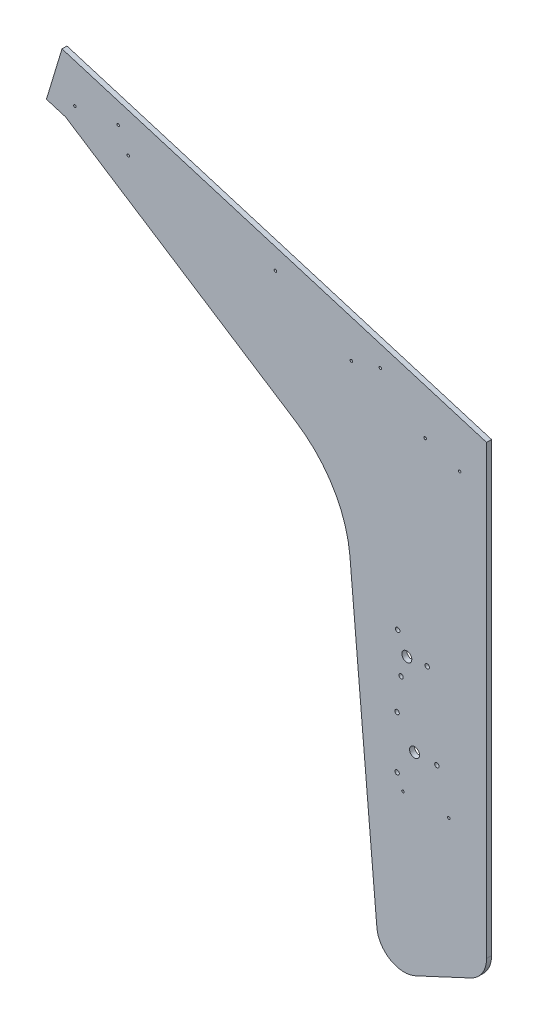
ISO-10303-21;
HEADER;
FILE_DESCRIPTION(('STEP AP214'),'2;1');
FILE_NAME('part.step','',(''),(''),'','','');
FILE_SCHEMA(('AUTOMOTIVE_DESIGN { 1 0 10303 214 1 1 1 1 }'));
ENDSEC;
DATA;
#1=APPLICATION_CONTEXT('core data for automotive mechanical design processes');
#2=APPLICATION_PROTOCOL_DEFINITION('international standard','automotive_design',2000,#1);
#3=PRODUCT_CONTEXT('',#1,'mechanical');
#4=PRODUCT('Part','Part','',(#3));
#5=PRODUCT_RELATED_PRODUCT_CATEGORY('part','',(#4));
#6=PRODUCT_DEFINITION_FORMATION('','',#4);
#7=PRODUCT_DEFINITION_CONTEXT('part definition',#1,'design');
#8=PRODUCT_DEFINITION('design','',#6,#7);
#9=PRODUCT_DEFINITION_SHAPE('','',#8);
#10=(LENGTH_UNIT() NAMED_UNIT(*) SI_UNIT(.MILLI.,.METRE.));
#11=(NAMED_UNIT(*) PLANE_ANGLE_UNIT() SI_UNIT($,.RADIAN.));
#12=(NAMED_UNIT(*) SI_UNIT($,.STERADIAN.) SOLID_ANGLE_UNIT());
#13=UNCERTAINTY_MEASURE_WITH_UNIT(LENGTH_MEASURE(1.E-05),#10,'distance_accuracy_value','');
#14=(GEOMETRIC_REPRESENTATION_CONTEXT(3) GLOBAL_UNCERTAINTY_ASSIGNED_CONTEXT((#13)) GLOBAL_UNIT_ASSIGNED_CONTEXT((#10,
#11,#12)) REPRESENTATION_CONTEXT('',''));
#15=CARTESIAN_POINT('',(0.,0.,0.));
#16=DIRECTION('',(0.,0.,1.));
#17=DIRECTION('',(1.,0.,0.));
#18=AXIS2_PLACEMENT_3D('',#15,#16,#17);
#19=CARTESIAN_POINT('',(-187.669471419218,27.9834711613111,0.));
#20=DIRECTION('',(0.,0.,1.));
#21=DIRECTION('',(1.,0.,0.));
#22=AXIS2_PLACEMENT_3D('',#19,#20,#21);
#23=PLANE('',#22);
#24=CARTESIAN_POINT('',(31.7500000000008,-184.289377226082,0.));
#25=DIRECTION('',(0.,0.,1.));
#26=DIRECTION('',(1.,0.,0.));
#27=AXIS2_PLACEMENT_3D('',#24,#25,#26);
#28=CIRCLE('',#27,1.5875);
#29=CARTESIAN_POINT('',(33.3375000000008,-184.289377226082,0.));
#30=VERTEX_POINT('',#29);
#31=EDGE_CURVE('E215',#30,#30,#28,.T.);
#32=ORIENTED_EDGE('',*,*,#31,.T.);
#33=EDGE_LOOP('',(#32));
#34=FACE_BOUND('',#33,.T.);
#35=CARTESIAN_POINT('',(90.2500000000045,-184.289377226082,0.));
#36=DIRECTION('',(0.,0.,1.));
#37=DIRECTION('',(1.,0.,0.));
#38=AXIS2_PLACEMENT_3D('',#35,#36,#37);
#39=CIRCLE('',#38,1.58750000000001);
#40=CARTESIAN_POINT('',(91.8375000000046,-184.289377226082,0.));
#41=VERTEX_POINT('',#40);
#42=EDGE_CURVE('E212',#41,#41,#39,.T.);
#43=ORIENTED_EDGE('',*,*,#42,.T.);
#44=EDGE_LOOP('',(#43));
#45=FACE_BOUND('',#44,.T.);
#46=CARTESIAN_POINT('',(103.943310592977,205.283262573305,0.));
#47=DIRECTION('',(0.,0.,1.));
#48=DIRECTION('',(1.,0.,0.));
#49=AXIS2_PLACEMENT_3D('',#46,#47,#48);
#50=CIRCLE('',#49,1.58750000000001);
#51=CARTESIAN_POINT('',(105.530810592977,205.283262573305,0.));
#52=VERTEX_POINT('',#51);
#53=EDGE_CURVE('E210',#52,#52,#50,.T.);
#54=ORIENTED_EDGE('',*,*,#53,.T.);
#55=EDGE_LOOP('',(#54));
#56=FACE_BOUND('',#55,.T.);
#57=CARTESIAN_POINT('',(60.0553843555323,220.039497831415,0.));
#58=DIRECTION('',(0.,0.,1.));
#59=DIRECTION('',(1.,0.,0.));
#60=AXIS2_PLACEMENT_3D('',#57,#58,#59);
#61=CIRCLE('',#60,1.5875);
#62=CARTESIAN_POINT('',(61.6428843555323,220.039497831415,0.));
#63=VERTEX_POINT('',#62);
#64=EDGE_CURVE('E205',#63,#63,#61,.T.);
#65=ORIENTED_EDGE('',*,*,#64,.T.);
#66=EDGE_LOOP('',(#65));
#67=FACE_BOUND('',#66,.T.);
#68=CARTESIAN_POINT('',(-34.0798681597778,258.346163074248,0.));
#69=DIRECTION('',(0.,0.,1.));
#70=DIRECTION('',(1.,0.,0.));
#71=AXIS2_PLACEMENT_3D('',#68,#69,#70);
#72=CIRCLE('',#71,1.5875);
#73=CARTESIAN_POINT('',(-32.4923681597778,258.346163074248,0.));
#74=VERTEX_POINT('',#73);
#75=EDGE_CURVE('E201',#74,#74,#72,.T.);
#76=ORIENTED_EDGE('',*,*,#75,.T.);
#77=EDGE_LOOP('',(#76));
#78=FACE_BOUND('',#77,.T.);
#79=CARTESIAN_POINT('',(-386.575717556954,363.409638801987,0.));
#80=DIRECTION('',(0.,0.,1.));
#81=DIRECTION('',(1.,0.,0.));
#82=AXIS2_PLACEMENT_3D('',#79,#80,#81);
#83=CIRCLE('',#82,1.58750000000002);
#84=CARTESIAN_POINT('',(-384.988217556954,363.409638801987,0.));
#85=VERTEX_POINT('',#84);
#86=EDGE_CURVE('E197',#85,#85,#83,.T.);
#87=ORIENTED_EDGE('',*,*,#86,.T.);
#88=EDGE_LOOP('',(#87));
#89=FACE_BOUND('',#88,.T.);
#90=CARTESIAN_POINT('',(-318.556726679748,342.823333651918,0.));
#91=DIRECTION('',(0.,0.,1.));
#92=DIRECTION('',(1.,0.,0.));
#93=AXIS2_PLACEMENT_3D('',#90,#91,#92);
#94=CIRCLE('',#93,1.58750000000002);
#95=CARTESIAN_POINT('',(-316.969226679748,342.823333651918,0.));
#96=VERTEX_POINT('',#95);
#97=EDGE_CURVE('E193',#96,#96,#94,.T.);
#98=ORIENTED_EDGE('',*,*,#97,.T.);
#99=EDGE_LOOP('',(#98));
#100=FACE_BOUND('',#99,.T.);
#101=CARTESIAN_POINT('',(-130.880979991016,309.493209449229,0.));
#102=DIRECTION('',(0.,0.,1.));
#103=DIRECTION('',(1.,0.,0.));
#104=AXIS2_PLACEMENT_3D('',#101,#102,#103);
#105=CIRCLE('',#104,1.58749999999999);
#106=CARTESIAN_POINT('',(-129.293479991016,309.493209449229,0.));
#107=VERTEX_POINT('',#106);
#108=EDGE_CURVE('E190',#107,#107,#105,.T.);
#109=ORIENTED_EDGE('',*,*,#108,.T.);
#110=EDGE_LOOP('',(#109));
#111=FACE_BOUND('',#110,.T.);
#112=CARTESIAN_POINT('',(2.82923956893905,269.025108613784,0.));
#113=DIRECTION('',(0.,0.,1.));
#114=DIRECTION('',(1.,0.,0.));
#115=AXIS2_PLACEMENT_3D('',#112,#113,#114);
#116=CIRCLE('',#115,1.5875);
#117=CARTESIAN_POINT('',(4.41673956893905,269.025108613784,0.));
#118=VERTEX_POINT('',#117);
#119=EDGE_CURVE('E185',#118,#118,#116,.T.);
#120=ORIENTED_EDGE('',*,*,#119,.T.);
#121=EDGE_LOOP('',(#120));
#122=FACE_BOUND('',#121,.T.);
#123=CARTESIAN_POINT('',(-331.446309330948,370.195360702396,0.));
#124=DIRECTION('',(0.,0.,1.));
#125=DIRECTION('',(1.,0.,0.));
#126=AXIS2_PLACEMENT_3D('',#123,#124,#125);
#127=CIRCLE('',#126,1.58750000000002);
#128=CARTESIAN_POINT('',(-329.858809330948,370.195360702396,0.));
#129=VERTEX_POINT('',#128);
#130=EDGE_CURVE('E184',#129,#129,#127,.T.);
#131=ORIENTED_EDGE('',*,*,#130,.T.);
#132=EDGE_LOOP('',(#131));
#133=FACE_BOUND('',#132,.T.);
#134=CARTESIAN_POINT('',(46.4766838917456,-133.689377226091,0.));
#135=DIRECTION('',(0.,0.,-1.));
#136=DIRECTION('',(-1.,0.,0.));
#137=AXIS2_PLACEMENT_3D('',#134,#135,#136);
#138=CIRCLE('',#137,6.35000000000762);
#139=CARTESIAN_POINT('',(40.126683891738,-133.689377226091,0.));
#140=VERTEX_POINT('',#139);
#141=EDGE_CURVE('E247',#140,#140,#138,.T.);
#142=ORIENTED_EDGE('',*,*,#141,.F.);
#143=EDGE_LOOP('',(#142));
#144=FACE_BOUND('',#143,.T.);
#145=CARTESIAN_POINT('',(36.660568119695,-32.9207261319309,0.));
#146=DIRECTION('',(0.,0.,-1.));
#147=DIRECTION('',(-1.,0.,0.));
#148=AXIS2_PLACEMENT_3D('',#145,#146,#147);
#149=CIRCLE('',#148,6.34999999999949);
#150=CARTESIAN_POINT('',(30.3105681196955,-32.9207261319309,0.));
#151=VERTEX_POINT('',#150);
#152=EDGE_CURVE('E242',#151,#151,#149,.T.);
#153=ORIENTED_EDGE('',*,*,#152,.F.);
#154=EDGE_LOOP('',(#153));
#155=FACE_BOUND('',#154,.T.);
#156=CARTESIAN_POINT('',(24.2516838917456,-100.351877226091,0.));
#157=DIRECTION('',(0.,0.,-1.));
#158=DIRECTION('',(-1.,0.,0.));
#159=AXIS2_PLACEMENT_3D('',#156,#157,#158);
#160=CIRCLE('',#159,2.80669999999999);
#161=CARTESIAN_POINT('',(21.4449838917456,-100.351877226091,0.));
#162=VERTEX_POINT('',#161);
#163=EDGE_CURVE('E246',#162,#162,#160,.T.);
#164=ORIENTED_EDGE('',*,*,#163,.F.);
#165=EDGE_LOOP('',(#164));
#166=FACE_BOUND('',#165,.T.);
#167=CARTESIAN_POINT('',(24.2516838917456,-167.026877226091,0.));
#168=DIRECTION('',(0.,0.,-1.));
#169=DIRECTION('',(-1.,0.,0.));
#170=AXIS2_PLACEMENT_3D('',#167,#168,#169);
#171=CIRCLE('',#170,2.80669999999999);
#172=CARTESIAN_POINT('',(21.4449838917456,-167.026877226091,0.));
#173=VERTEX_POINT('',#172);
#174=EDGE_CURVE('E260',#173,#173,#171,.T.);
#175=ORIENTED_EDGE('',*,*,#174,.F.);
#176=EDGE_LOOP('',(#175));
#177=FACE_BOUND('',#176,.T.);
#178=CARTESIAN_POINT('',(75.0516838917456,-133.689377226091,0.));
#179=DIRECTION('',(0.,0.,-1.));
#180=DIRECTION('',(-1.,0.,0.));
#181=AXIS2_PLACEMENT_3D('',#178,#179,#180);
#182=CIRCLE('',#181,2.80669999999998);
#183=CARTESIAN_POINT('',(72.2449838917456,-133.689377226091,0.));
#184=VERTEX_POINT('',#183);
#185=EDGE_CURVE('E266',#184,#184,#182,.T.);
#186=ORIENTED_EDGE('',*,*,#185,.F.);
#187=EDGE_LOOP('',(#186));
#188=FACE_BOUND('',#187,.T.);
#189=CARTESIAN_POINT('',(29.3173696682906,-58.2747024278338,0.));
#190=DIRECTION('',(0.,0.,-1.));
#191=DIRECTION('',(-1.,0.,0.));
#192=AXIS2_PLACEMENT_3D('',#189,#190,#191);
#193=CIRCLE('',#192,2.80669999999999);
#194=CARTESIAN_POINT('',(26.5106696682906,-58.2747024278338,0.));
#195=VERTEX_POINT('',#194);
#196=EDGE_CURVE('E272',#195,#195,#193,.T.);
#197=ORIENTED_EDGE('',*,*,#196,.F.);
#198=EDGE_LOOP('',(#197));
#199=FACE_BOUND('',#198,.T.);
#200=CARTESIAN_POINT('',(62.6487752038756,-30.6470526267015,0.));
#201=DIRECTION('',(0.,0.,-1.));
#202=DIRECTION('',(-1.,0.,0.));
#203=AXIS2_PLACEMENT_3D('',#200,#201,#202);
#204=CIRCLE('',#203,2.8067);
#205=CARTESIAN_POINT('',(59.8420752038756,-30.6470526267015,0.));
#206=VERTEX_POINT('',#205);
#207=EDGE_CURVE('E284',#206,#206,#204,.T.);
#208=ORIENTED_EDGE('',*,*,#207,.F.);
#209=EDGE_LOOP('',(#208));
#210=FACE_BOUND('',#209,.T.);
#211=CARTESIAN_POINT('',(-187.669471419218,27.9834711613111,0.));
#212=DIRECTION('',(0.,0.,-1.));
#213=DIRECTION('',(1.,0.,0.));
#214=AXIS2_PLACEMENT_3D('',#211,#212,#213);
#215=CIRCLE('',#214,152.4);
#216=CARTESIAN_POINT('',(-105.026598758452,156.030008007789,0.));
#217=VERTEX_POINT('',#216);
#218=CARTESIAN_POINT('',(-35.929687434797,42.1537907187927,0.));
#219=VERTEX_POINT('',#218);
#220=EDGE_CURVE('E144',#217,#219,#215,.T.);
#221=ORIENTED_EDGE('',*,*,#220,.F.);
#222=DIRECTION('',(0.840200373008384,-0.542276067327862,0.));
#223=VECTOR('',#222,1.);
#224=CARTESIAN_POINT('',(-398.624090476111,345.521584422964,0.));
#225=LINE('',#224,#223);
#226=CARTESIAN_POINT('',(-398.624090476111,345.521584422964,0.));
#227=VERTEX_POINT('',#226);
#228=EDGE_CURVE('E93',#227,#217,#225,.T.);
#229=ORIENTED_EDGE('',*,*,#228,.F.);
#230=DIRECTION('',(0.957123976807143,-0.289678602973846,0.));
#231=VECTOR('',#230,1.);
#232=CARTESIAN_POINT('',(-422.935039487013,352.879420938499,0.));
#233=LINE('',#232,#231);
#234=CARTESIAN_POINT('',(-422.935039487013,352.879420938499,0.));
#235=VERTEX_POINT('',#234);
#236=EDGE_CURVE('E87',#235,#227,#233,.T.);
#237=ORIENTED_EDGE('',*,*,#236,.F.);
#238=DIRECTION('',(-0.289678602973846,-0.957123976807143,0.));
#239=VECTOR('',#238,1.);
#240=CARTESIAN_POINT('',(-403.099057100862,418.419278388803,0.));
#241=LINE('',#240,#239);
#242=CARTESIAN_POINT('',(-403.099057100862,418.419278388803,0.));
#243=VERTEX_POINT('',#242);
#244=EDGE_CURVE('E134',#243,#235,#241,.T.);
#245=ORIENTED_EDGE('',*,*,#244,.F.);
#246=DIRECTION('',(-0.957123976807143,0.289678602973846,0.));
#247=VECTOR('',#246,1.);
#248=CARTESIAN_POINT('',(138.378918257769,254.538122714234,0.));
#249=LINE('',#248,#247);
#250=CARTESIAN_POINT('',(138.378918257769,254.538122714234,0.));
#251=VERTEX_POINT('',#250);
#252=EDGE_CURVE('E158',#251,#243,#249,.T.);
#253=ORIENTED_EDGE('',*,*,#252,.F.);
#254=DIRECTION('',(0.,1.,0.));
#255=VECTOR('',#254,1.);
#256=CARTESIAN_POINT('',(138.378918257769,-315.453385963652,0.));
#257=LINE('',#256,#255);
#258=CARTESIAN_POINT('',(138.378918257769,-315.453385963652,0.));
#259=VERTEX_POINT('',#258);
#260=EDGE_CURVE('E156',#259,#251,#257,.T.);
#261=ORIENTED_EDGE('',*,*,#260,.F.);
#262=CARTESIAN_POINT('',(103.453918257769,-315.453385963652,0.));
#263=DIRECTION('',(0.,0.,1.));
#264=DIRECTION('',(1.,0.,0.));
#265=AXIS2_PLACEMENT_3D('',#262,#263,#264);
#266=CIRCLE('',#265,34.925);
#267=CARTESIAN_POINT('',(118.213861049063,-347.106185425907,0.));
#268=VERTEX_POINT('',#267);
#269=EDGE_CURVE('E154',#268,#259,#266,.T.);
#270=ORIENTED_EDGE('',*,*,#269,.F.);
#271=DIRECTION('',(0.906307787036646,0.422618261740709,0.));
#272=VECTOR('',#271,1.);
#273=CARTESIAN_POINT('',(48.0381691425684,-379.829647978231,0.));
#274=LINE('',#273,#272);
#275=CARTESIAN_POINT('',(48.0381691425684,-379.829647978231,0.));
#276=VERTEX_POINT('',#275);
#277=EDGE_CURVE('E152',#276,#268,#274,.T.);
#278=ORIENTED_EDGE('',*,*,#277,.F.);
#279=CARTESIAN_POINT('',(33.2782263512746,-348.176848515976,0.));
#280=DIRECTION('',(0.,0.,1.));
#281=DIRECTION('',(1.,0.,0.));
#282=AXIS2_PLACEMENT_3D('',#279,#280,#281);
#283=CIRCLE('',#282,34.925);
#284=CARTESIAN_POINT('',(-1.51387347957959,-351.220762831439,0.));
#285=VERTEX_POINT('',#284);
#286=EDGE_CURVE('E150',#285,#276,#283,.T.);
#287=ORIENTED_EDGE('',*,*,#286,.F.);
#288=DIRECTION('',(0.0871557427476597,-0.996194698091745,0.));
#289=VECTOR('',#288,1.);
#290=CARTESIAN_POINT('',(-35.929687434797,42.1537907187927,0.));
#291=LINE('',#290,#289);
#292=EDGE_CURVE('E147',#219,#285,#291,.T.);
#293=ORIENTED_EDGE('',*,*,#292,.F.);
#294=EDGE_LOOP('',(#221,#229,#237,#245,#253,#261,#270,#278,#287,#293));
#295=FACE_BOUND('',#294,.T.);
#296=CARTESIAN_POINT('',(25.0262575724516,-9.22706673537058,0.));
#297=DIRECTION('',(0.,0.,-1.));
#298=DIRECTION('',(-1.,0.,0.));
#299=AXIS2_PLACEMENT_3D('',#296,#297,#298);
#300=CIRCLE('',#299,2.80669999999999);
#301=CARTESIAN_POINT('',(22.2195575724516,-9.22706673537058,0.));
#302=VERTEX_POINT('',#301);
#303=EDGE_CURVE('E278',#302,#302,#300,.T.);
#304=ORIENTED_EDGE('',*,*,#303,.F.);
#305=EDGE_LOOP('',(#304));
#306=FACE_BOUND('',#305,.T.);
#307=ADVANCED_FACE('F33',(#34,#45,#56,#67,#78,#89,#100,#111,#122,#133,#144,#155,#166,#177,#188,
#199,#210,#295,#306),#23,.F.);
#308=CARTESIAN_POINT('',(-187.669471419218,27.9834711613111,6.35));
#309=DIRECTION('',(0.,0.,-1.));
#310=DIRECTION('',(-1.,0.,0.));
#311=AXIS2_PLACEMENT_3D('',#308,#309,#310);
#312=CYLINDRICAL_SURFACE('',#311,152.4);
#313=ORIENTED_EDGE('',*,*,#220,.T.);
#314=DIRECTION('',(0.,0.,-1.));
#315=VECTOR('',#314,1.);
#316=CARTESIAN_POINT('',(-35.929687434797,42.1537907187927,6.35));
#317=LINE('',#316,#315);
#318=CARTESIAN_POINT('',(-35.929687434797,42.1537907187927,6.35));
#319=VERTEX_POINT('',#318);
#320=EDGE_CURVE('E11',#319,#219,#317,.T.);
#321=ORIENTED_EDGE('',*,*,#320,.F.);
#322=CARTESIAN_POINT('',(-187.669471419218,27.9834711613111,6.35));
#323=DIRECTION('',(0.,0.,-1.));
#324=DIRECTION('',(1.,0.,0.));
#325=AXIS2_PLACEMENT_3D('',#322,#323,#324);
#326=CIRCLE('',#325,152.4);
#327=CARTESIAN_POINT('',(-105.026598758452,156.030008007789,6.35));
#328=VERTEX_POINT('',#327);
#329=EDGE_CURVE('E163',#328,#319,#326,.T.);
#330=ORIENTED_EDGE('',*,*,#329,.F.);
#331=DIRECTION('',(0.,0.,-1.));
#332=VECTOR('',#331,1.);
#333=CARTESIAN_POINT('',(-105.026598758452,156.030008007789,6.35));
#334=LINE('',#333,#332);
#335=EDGE_CURVE('E140',#328,#217,#334,.T.);
#336=ORIENTED_EDGE('',*,*,#335,.T.);
#337=EDGE_LOOP('',(#313,#321,#330,#336));
#338=FACE_BOUND('',#337,.T.);
#339=ADVANCED_FACE('F35',(#338),#312,.F.);
#340=CARTESIAN_POINT('',(-35.929687434797,42.1537907187927,6.35));
#341=DIRECTION('',(0.996194698091745,0.0871557427476597,0.));
#342=DIRECTION('',(-0.0871557427476597,0.996194698091745,0.));
#343=AXIS2_PLACEMENT_3D('',#340,#341,#342);
#344=PLANE('',#343);
#345=ORIENTED_EDGE('',*,*,#292,.T.);
#346=DIRECTION('',(0.,0.,-1.));
#347=VECTOR('',#346,1.);
#348=CARTESIAN_POINT('',(-1.51387347957959,-351.220762831439,6.35));
#349=LINE('',#348,#347);
#350=CARTESIAN_POINT('',(-1.51387347957959,-351.220762831439,6.35));
#351=VERTEX_POINT('',#350);
#352=EDGE_CURVE('E43',#351,#285,#349,.T.);
#353=ORIENTED_EDGE('',*,*,#352,.F.);
#354=DIRECTION('',(0.0871557427476597,-0.996194698091745,0.));
#355=VECTOR('',#354,1.);
#356=CARTESIAN_POINT('',(-35.929687434797,42.1537907187927,6.35));
#357=LINE('',#356,#355);
#358=EDGE_CURVE('E101',#319,#351,#357,.T.);
#359=ORIENTED_EDGE('',*,*,#358,.F.);
#360=ORIENTED_EDGE('',*,*,#320,.T.);
#361=EDGE_LOOP('',(#345,#353,#359,#360));
#362=FACE_BOUND('',#361,.T.);
#363=ADVANCED_FACE('F331',(#362),#344,.F.);
#364=CARTESIAN_POINT('',(33.2782263512746,-348.176848515976,6.35));
#365=DIRECTION('',(0.,0.,-1.));
#366=DIRECTION('',(-1.,0.,0.));
#367=AXIS2_PLACEMENT_3D('',#364,#365,#366);
#368=CYLINDRICAL_SURFACE('',#367,34.925);
#369=ORIENTED_EDGE('',*,*,#286,.T.);
#370=DIRECTION('',(0.,0.,-1.));
#371=VECTOR('',#370,1.);
#372=CARTESIAN_POINT('',(48.0381691425684,-379.829647978231,6.35));
#373=LINE('',#372,#371);
#374=CARTESIAN_POINT('',(48.0381691425684,-379.829647978231,6.35));
#375=VERTEX_POINT('',#374);
#376=EDGE_CURVE('E176',#375,#276,#373,.T.);
#377=ORIENTED_EDGE('',*,*,#376,.F.);
#378=CARTESIAN_POINT('',(33.2782263512746,-348.176848515976,6.35));
#379=DIRECTION('',(0.,0.,1.));
#380=DIRECTION('',(1.,0.,0.));
#381=AXIS2_PLACEMENT_3D('',#378,#379,#380);
#382=CIRCLE('',#381,34.925);
#383=EDGE_CURVE('E291',#351,#375,#382,.T.);
#384=ORIENTED_EDGE('',*,*,#383,.F.);
#385=ORIENTED_EDGE('',*,*,#352,.T.);
#386=EDGE_LOOP('',(#369,#377,#384,#385));
#387=FACE_BOUND('',#386,.T.);
#388=ADVANCED_FACE('F649',(#387),#368,.T.);
#389=CARTESIAN_POINT('',(48.0381691425684,-379.829647978231,6.35));
#390=DIRECTION('',(-0.422618261740709,0.906307787036646,0.));
#391=DIRECTION('',(-0.906307787036646,-0.422618261740709,0.));
#392=AXIS2_PLACEMENT_3D('',#389,#390,#391);
#393=PLANE('',#392);
#394=ORIENTED_EDGE('',*,*,#277,.T.);
#395=DIRECTION('',(0.,0.,-1.));
#396=VECTOR('',#395,1.);
#397=CARTESIAN_POINT('',(118.213861049063,-347.106185425907,6.35));
#398=LINE('',#397,#396);
#399=CARTESIAN_POINT('',(118.213861049063,-347.106185425907,6.35));
#400=VERTEX_POINT('',#399);
#401=EDGE_CURVE('E173',#400,#268,#398,.T.);
#402=ORIENTED_EDGE('',*,*,#401,.F.);
#403=DIRECTION('',(0.906307787036646,0.422618261740709,0.));
#404=VECTOR('',#403,1.);
#405=CARTESIAN_POINT('',(48.0381691425684,-379.829647978231,6.35));
#406=LINE('',#405,#404);
#407=EDGE_CURVE('E293',#375,#400,#406,.T.);
#408=ORIENTED_EDGE('',*,*,#407,.F.);
#409=ORIENTED_EDGE('',*,*,#376,.T.);
#410=EDGE_LOOP('',(#394,#402,#408,#409));
#411=FACE_BOUND('',#410,.T.);
#412=ADVANCED_FACE('F640',(#411),#393,.F.);
#413=CARTESIAN_POINT('',(103.453918257769,-315.453385963652,6.35));
#414=DIRECTION('',(0.,0.,-1.));
#415=DIRECTION('',(-1.,0.,0.));
#416=AXIS2_PLACEMENT_3D('',#413,#414,#415);
#417=CYLINDRICAL_SURFACE('',#416,34.925);
#418=ORIENTED_EDGE('',*,*,#269,.T.);
#419=DIRECTION('',(0.,0.,-1.));
#420=VECTOR('',#419,1.);
#421=CARTESIAN_POINT('',(138.378918257769,-315.453385963652,6.35));
#422=LINE('',#421,#420);
#423=CARTESIAN_POINT('',(138.378918257769,-315.453385963652,6.35));
#424=VERTEX_POINT('',#423);
#425=EDGE_CURVE('E170',#424,#259,#422,.T.);
#426=ORIENTED_EDGE('',*,*,#425,.F.);
#427=CARTESIAN_POINT('',(103.453918257769,-315.453385963652,6.35));
#428=DIRECTION('',(0.,0.,1.));
#429=DIRECTION('',(1.,0.,0.));
#430=AXIS2_PLACEMENT_3D('',#427,#428,#429);
#431=CIRCLE('',#430,34.925);
#432=EDGE_CURVE('E295',#400,#424,#431,.T.);
#433=ORIENTED_EDGE('',*,*,#432,.F.);
#434=ORIENTED_EDGE('',*,*,#401,.T.);
#435=EDGE_LOOP('',(#418,#426,#433,#434));
#436=FACE_BOUND('',#435,.T.);
#437=ADVANCED_FACE('F632',(#436),#417,.T.);
#438=CARTESIAN_POINT('',(138.378918257769,-315.453385963652,6.35));
#439=DIRECTION('',(-1.,0.,0.));
#440=DIRECTION('',(0.,-1.,0.));
#441=AXIS2_PLACEMENT_3D('',#438,#439,#440);
#442=PLANE('',#441);
#443=ORIENTED_EDGE('',*,*,#260,.T.);
#444=DIRECTION('',(0.,0.,-1.));
#445=VECTOR('',#444,1.);
#446=CARTESIAN_POINT('',(138.378918257769,254.538122714234,6.35));
#447=LINE('',#446,#445);
#448=CARTESIAN_POINT('',(138.378918257769,254.538122714234,6.35));
#449=VERTEX_POINT('',#448);
#450=EDGE_CURVE('E167',#449,#251,#447,.T.);
#451=ORIENTED_EDGE('',*,*,#450,.F.);
#452=DIRECTION('',(0.,1.,0.));
#453=VECTOR('',#452,1.);
#454=CARTESIAN_POINT('',(138.378918257769,-315.453385963652,6.35));
#455=LINE('',#454,#453);
#456=EDGE_CURVE('E297',#424,#449,#455,.T.);
#457=ORIENTED_EDGE('',*,*,#456,.F.);
#458=ORIENTED_EDGE('',*,*,#425,.T.);
#459=EDGE_LOOP('',(#443,#451,#457,#458));
#460=FACE_BOUND('',#459,.T.);
#461=ADVANCED_FACE('F303',(#460),#442,.F.);
#462=CARTESIAN_POINT('',(138.378918257769,254.538122714234,6.35));
#463=DIRECTION('',(-0.289678602973846,-0.957123976807143,0.));
#464=DIRECTION('',(0.957123976807143,-0.289678602973846,0.));
#465=AXIS2_PLACEMENT_3D('',#462,#463,#464);
#466=PLANE('',#465);
#467=ORIENTED_EDGE('',*,*,#252,.T.);
#468=DIRECTION('',(0.,0.,-1.));
#469=VECTOR('',#468,1.);
#470=CARTESIAN_POINT('',(-403.099057100862,418.419278388803,6.35));
#471=LINE('',#470,#469);
#472=CARTESIAN_POINT('',(-403.099057100862,418.419278388803,6.35));
#473=VERTEX_POINT('',#472);
#474=EDGE_CURVE('E135',#473,#243,#471,.T.);
#475=ORIENTED_EDGE('',*,*,#474,.F.);
#476=DIRECTION('',(-0.957123976807143,0.289678602973846,0.));
#477=VECTOR('',#476,1.);
#478=CARTESIAN_POINT('',(138.378918257769,254.538122714234,6.35));
#479=LINE('',#478,#477);
#480=EDGE_CURVE('E126',#449,#473,#479,.T.);
#481=ORIENTED_EDGE('',*,*,#480,.F.);
#482=ORIENTED_EDGE('',*,*,#450,.T.);
#483=EDGE_LOOP('',(#467,#475,#481,#482));
#484=FACE_BOUND('',#483,.T.);
#485=ADVANCED_FACE('F307',(#484),#466,.F.);
#486=CARTESIAN_POINT('',(-403.099057100862,418.419278388803,6.35));
#487=DIRECTION('',(0.957123976807143,-0.289678602973846,0.));
#488=DIRECTION('',(0.289678602973846,0.957123976807143,0.));
#489=AXIS2_PLACEMENT_3D('',#486,#487,#488);
#490=PLANE('',#489);
#491=ORIENTED_EDGE('',*,*,#244,.T.);
#492=DIRECTION('',(0.,0.,-1.));
#493=VECTOR('',#492,1.);
#494=CARTESIAN_POINT('',(-422.935039487013,352.879420938499,6.35));
#495=LINE('',#494,#493);
#496=CARTESIAN_POINT('',(-422.935039487013,352.879420938499,6.35));
#497=VERTEX_POINT('',#496);
#498=EDGE_CURVE('E131',#497,#235,#495,.T.);
#499=ORIENTED_EDGE('',*,*,#498,.F.);
#500=DIRECTION('',(-0.289678602973846,-0.957123976807143,0.));
#501=VECTOR('',#500,1.);
#502=CARTESIAN_POINT('',(-403.099057100862,418.419278388803,6.35));
#503=LINE('',#502,#501);
#504=EDGE_CURVE('E120',#473,#497,#503,.T.);
#505=ORIENTED_EDGE('',*,*,#504,.F.);
#506=ORIENTED_EDGE('',*,*,#474,.T.);
#507=EDGE_LOOP('',(#491,#499,#505,#506));
#508=FACE_BOUND('',#507,.T.);
#509=ADVANCED_FACE('F132',(#508),#490,.F.);
#510=CARTESIAN_POINT('',(-422.935039487013,352.879420938499,6.35));
#511=DIRECTION('',(0.289678602973846,0.957123976807143,0.));
#512=DIRECTION('',(-0.957123976807143,0.289678602973846,0.));
#513=AXIS2_PLACEMENT_3D('',#510,#511,#512);
#514=PLANE('',#513);
#515=ORIENTED_EDGE('',*,*,#236,.T.);
#516=DIRECTION('',(0.,0.,-1.));
#517=VECTOR('',#516,1.);
#518=CARTESIAN_POINT('',(-398.624090476111,345.521584422964,6.35));
#519=LINE('',#518,#517);
#520=CARTESIAN_POINT('',(-398.624090476111,345.521584422964,6.35));
#521=VERTEX_POINT('',#520);
#522=EDGE_CURVE('E136',#521,#227,#519,.T.);
#523=ORIENTED_EDGE('',*,*,#522,.F.);
#524=DIRECTION('',(0.957123976807143,-0.289678602973846,0.));
#525=VECTOR('',#524,1.);
#526=CARTESIAN_POINT('',(-422.935039487013,352.879420938499,6.35));
#527=LINE('',#526,#525);
#528=EDGE_CURVE('E124',#497,#521,#527,.T.);
#529=ORIENTED_EDGE('',*,*,#528,.F.);
#530=ORIENTED_EDGE('',*,*,#498,.T.);
#531=EDGE_LOOP('',(#515,#523,#529,#530));
#532=FACE_BOUND('',#531,.T.);
#533=ADVANCED_FACE('F138',(#532),#514,.F.);
#534=CARTESIAN_POINT('',(-398.624090476111,345.521584422964,6.35));
#535=DIRECTION('',(0.542276067327862,0.840200373008384,0.));
#536=DIRECTION('',(-0.840200373008384,0.542276067327862,0.));
#537=AXIS2_PLACEMENT_3D('',#534,#535,#536);
#538=PLANE('',#537);
#539=ORIENTED_EDGE('',*,*,#228,.T.);
#540=ORIENTED_EDGE('',*,*,#335,.F.);
#541=DIRECTION('',(0.840200373008384,-0.542276067327862,0.));
#542=VECTOR('',#541,1.);
#543=CARTESIAN_POINT('',(-398.624090476111,345.521584422964,6.35));
#544=LINE('',#543,#542);
#545=EDGE_CURVE('E52',#521,#328,#544,.T.);
#546=ORIENTED_EDGE('',*,*,#545,.F.);
#547=ORIENTED_EDGE('',*,*,#522,.T.);
#548=EDGE_LOOP('',(#539,#540,#546,#547));
#549=FACE_BOUND('',#548,.T.);
#550=ADVANCED_FACE('F315',(#549),#538,.F.);
#551=CARTESIAN_POINT('',(-187.669471419218,27.9834711613111,6.35));
#552=DIRECTION('',(0.,0.,1.));
#553=DIRECTION('',(1.,0.,0.));
#554=AXIS2_PLACEMENT_3D('',#551,#552,#553);
#555=PLANE('',#554);
#556=CARTESIAN_POINT('',(31.7500000000008,-184.289377226082,6.35));
#557=DIRECTION('',(0.,0.,1.));
#558=DIRECTION('',(1.,0.,0.));
#559=AXIS2_PLACEMENT_3D('',#556,#557,#558);
#560=CIRCLE('',#559,1.5875);
#561=CARTESIAN_POINT('',(33.3375000000008,-184.289377226082,6.35));
#562=VERTEX_POINT('',#561);
#563=EDGE_CURVE('E37',#562,#562,#560,.T.);
#564=ORIENTED_EDGE('',*,*,#563,.F.);
#565=EDGE_LOOP('',(#564));
#566=FACE_BOUND('',#565,.T.);
#567=CARTESIAN_POINT('',(90.2500000000045,-184.289377226082,6.35));
#568=DIRECTION('',(0.,0.,1.));
#569=DIRECTION('',(1.,0.,0.));
#570=AXIS2_PLACEMENT_3D('',#567,#568,#569);
#571=CIRCLE('',#570,1.58750000000001);
#572=CARTESIAN_POINT('',(91.8375000000046,-184.289377226082,6.35));
#573=VERTEX_POINT('',#572);
#574=EDGE_CURVE('E213',#573,#573,#571,.T.);
#575=ORIENTED_EDGE('',*,*,#574,.F.);
#576=EDGE_LOOP('',(#575));
#577=FACE_BOUND('',#576,.T.);
#578=CARTESIAN_POINT('',(103.943310592977,205.283262573305,6.35));
#579=DIRECTION('',(0.,0.,1.));
#580=DIRECTION('',(1.,0.,0.));
#581=AXIS2_PLACEMENT_3D('',#578,#579,#580);
#582=CIRCLE('',#581,1.58750000000001);
#583=CARTESIAN_POINT('',(105.530810592977,205.283262573305,6.35));
#584=VERTEX_POINT('',#583);
#585=EDGE_CURVE('E209',#584,#584,#582,.T.);
#586=ORIENTED_EDGE('',*,*,#585,.F.);
#587=EDGE_LOOP('',(#586));
#588=FACE_BOUND('',#587,.T.);
#589=CARTESIAN_POINT('',(60.0553843555323,220.039497831415,6.35));
#590=DIRECTION('',(0.,0.,1.));
#591=DIRECTION('',(1.,0.,0.));
#592=AXIS2_PLACEMENT_3D('',#589,#590,#591);
#593=CIRCLE('',#592,1.5875);
#594=CARTESIAN_POINT('',(61.6428843555323,220.039497831415,6.35));
#595=VERTEX_POINT('',#594);
#596=EDGE_CURVE('E206',#595,#595,#593,.T.);
#597=ORIENTED_EDGE('',*,*,#596,.F.);
#598=EDGE_LOOP('',(#597));
#599=FACE_BOUND('',#598,.T.);
#600=CARTESIAN_POINT('',(-34.0798681597778,258.346163074248,6.35));
#601=DIRECTION('',(0.,0.,1.));
#602=DIRECTION('',(1.,0.,0.));
#603=AXIS2_PLACEMENT_3D('',#600,#601,#602);
#604=CIRCLE('',#603,1.5875);
#605=CARTESIAN_POINT('',(-32.4923681597778,258.346163074248,6.35));
#606=VERTEX_POINT('',#605);
#607=EDGE_CURVE('E202',#606,#606,#604,.T.);
#608=ORIENTED_EDGE('',*,*,#607,.F.);
#609=EDGE_LOOP('',(#608));
#610=FACE_BOUND('',#609,.T.);
#611=CARTESIAN_POINT('',(-386.575717556954,363.409638801987,6.35));
#612=DIRECTION('',(0.,0.,1.));
#613=DIRECTION('',(1.,0.,0.));
#614=AXIS2_PLACEMENT_3D('',#611,#612,#613);
#615=CIRCLE('',#614,1.58750000000002);
#616=CARTESIAN_POINT('',(-384.988217556954,363.409638801987,6.35));
#617=VERTEX_POINT('',#616);
#618=EDGE_CURVE('E198',#617,#617,#615,.T.);
#619=ORIENTED_EDGE('',*,*,#618,.F.);
#620=EDGE_LOOP('',(#619));
#621=FACE_BOUND('',#620,.T.);
#622=CARTESIAN_POINT('',(-318.556726679748,342.823333651918,6.35));
#623=DIRECTION('',(0.,0.,1.));
#624=DIRECTION('',(1.,0.,0.));
#625=AXIS2_PLACEMENT_3D('',#622,#623,#624);
#626=CIRCLE('',#625,1.58750000000002);
#627=CARTESIAN_POINT('',(-316.969226679748,342.823333651918,6.35));
#628=VERTEX_POINT('',#627);
#629=EDGE_CURVE('E194',#628,#628,#626,.T.);
#630=ORIENTED_EDGE('',*,*,#629,.F.);
#631=EDGE_LOOP('',(#630));
#632=FACE_BOUND('',#631,.T.);
#633=CARTESIAN_POINT('',(-130.880979991016,309.493209449229,6.35));
#634=DIRECTION('',(0.,0.,1.));
#635=DIRECTION('',(1.,0.,0.));
#636=AXIS2_PLACEMENT_3D('',#633,#634,#635);
#637=CIRCLE('',#636,1.58749999999999);
#638=CARTESIAN_POINT('',(-129.293479991016,309.493209449229,6.35));
#639=VERTEX_POINT('',#638);
#640=EDGE_CURVE('E189',#639,#639,#637,.T.);
#641=ORIENTED_EDGE('',*,*,#640,.F.);
#642=EDGE_LOOP('',(#641));
#643=FACE_BOUND('',#642,.T.);
#644=CARTESIAN_POINT('',(2.82923956893905,269.025108613784,6.35));
#645=DIRECTION('',(0.,0.,1.));
#646=DIRECTION('',(1.,0.,0.));
#647=AXIS2_PLACEMENT_3D('',#644,#645,#646);
#648=CIRCLE('',#647,1.5875);
#649=CARTESIAN_POINT('',(4.41673956893905,269.025108613784,6.35));
#650=VERTEX_POINT('',#649);
#651=EDGE_CURVE('E186',#650,#650,#648,.T.);
#652=ORIENTED_EDGE('',*,*,#651,.F.);
#653=EDGE_LOOP('',(#652));
#654=FACE_BOUND('',#653,.T.);
#655=CARTESIAN_POINT('',(-331.446309330948,370.195360702396,6.35));
#656=DIRECTION('',(0.,0.,1.));
#657=DIRECTION('',(1.,0.,0.));
#658=AXIS2_PLACEMENT_3D('',#655,#656,#657);
#659=CIRCLE('',#658,1.58750000000002);
#660=CARTESIAN_POINT('',(-329.858809330948,370.195360702396,6.35));
#661=VERTEX_POINT('',#660);
#662=EDGE_CURVE('E181',#661,#661,#659,.T.);
#663=ORIENTED_EDGE('',*,*,#662,.F.);
#664=EDGE_LOOP('',(#663));
#665=FACE_BOUND('',#664,.T.);
#666=CARTESIAN_POINT('',(46.4766838917456,-133.689377226091,6.35));
#667=DIRECTION('',(0.,0.,-1.));
#668=DIRECTION('',(-1.,0.,0.));
#669=AXIS2_PLACEMENT_3D('',#666,#667,#668);
#670=CIRCLE('',#669,6.35000000000762);
#671=CARTESIAN_POINT('',(40.126683891738,-133.689377226091,6.35));
#672=VERTEX_POINT('',#671);
#673=EDGE_CURVE('E243',#672,#672,#670,.T.);
#674=ORIENTED_EDGE('',*,*,#673,.T.);
#675=EDGE_LOOP('',(#674));
#676=FACE_BOUND('',#675,.T.);
#677=CARTESIAN_POINT('',(36.660568119695,-32.9207261319309,6.35));
#678=DIRECTION('',(0.,0.,-1.));
#679=DIRECTION('',(-1.,0.,0.));
#680=AXIS2_PLACEMENT_3D('',#677,#678,#679);
#681=CIRCLE('',#680,6.34999999999949);
#682=CARTESIAN_POINT('',(30.3105681196955,-32.9207261319309,6.35));
#683=VERTEX_POINT('',#682);
#684=EDGE_CURVE('E250',#683,#683,#681,.T.);
#685=ORIENTED_EDGE('',*,*,#684,.T.);
#686=EDGE_LOOP('',(#685));
#687=FACE_BOUND('',#686,.T.);
#688=CARTESIAN_POINT('',(24.2516838917456,-100.351877226091,6.35));
#689=DIRECTION('',(0.,0.,-1.));
#690=DIRECTION('',(-1.,0.,0.));
#691=AXIS2_PLACEMENT_3D('',#688,#689,#690);
#692=CIRCLE('',#691,2.8067);
#693=CARTESIAN_POINT('',(21.4449838917456,-100.351877226091,6.35));
#694=VERTEX_POINT('',#693);
#695=EDGE_CURVE('E257',#694,#694,#692,.T.);
#696=ORIENTED_EDGE('',*,*,#695,.T.);
#697=EDGE_LOOP('',(#696));
#698=FACE_BOUND('',#697,.T.);
#699=CARTESIAN_POINT('',(24.2516838917456,-167.026877226091,6.35));
#700=DIRECTION('',(0.,0.,-1.));
#701=DIRECTION('',(-1.,0.,0.));
#702=AXIS2_PLACEMENT_3D('',#699,#700,#701);
#703=CIRCLE('',#702,2.8067);
#704=CARTESIAN_POINT('',(21.4449838917456,-167.026877226091,6.35));
#705=VERTEX_POINT('',#704);
#706=EDGE_CURVE('E263',#705,#705,#703,.T.);
#707=ORIENTED_EDGE('',*,*,#706,.T.);
#708=EDGE_LOOP('',(#707));
#709=FACE_BOUND('',#708,.T.);
#710=CARTESIAN_POINT('',(75.0516838917456,-133.689377226091,6.35));
#711=DIRECTION('',(0.,0.,-1.));
#712=DIRECTION('',(-1.,0.,0.));
#713=AXIS2_PLACEMENT_3D('',#710,#711,#712);
#714=CIRCLE('',#713,2.8067);
#715=CARTESIAN_POINT('',(72.2449838917456,-133.689377226091,6.35));
#716=VERTEX_POINT('',#715);
#717=EDGE_CURVE('E269',#716,#716,#714,.T.);
#718=ORIENTED_EDGE('',*,*,#717,.T.);
#719=EDGE_LOOP('',(#718));
#720=FACE_BOUND('',#719,.T.);
#721=CARTESIAN_POINT('',(29.3173696682906,-58.2747024278338,6.35));
#722=DIRECTION('',(0.,0.,-1.));
#723=DIRECTION('',(-1.,0.,0.));
#724=AXIS2_PLACEMENT_3D('',#721,#722,#723);
#725=CIRCLE('',#724,2.8067);
#726=CARTESIAN_POINT('',(26.5106696682906,-58.2747024278338,6.35));
#727=VERTEX_POINT('',#726);
#728=EDGE_CURVE('E275',#727,#727,#725,.T.);
#729=ORIENTED_EDGE('',*,*,#728,.T.);
#730=EDGE_LOOP('',(#729));
#731=FACE_BOUND('',#730,.T.);
#732=CARTESIAN_POINT('',(25.0262575724516,-9.22706673537058,6.35));
#733=DIRECTION('',(0.,0.,-1.));
#734=DIRECTION('',(-1.,0.,0.));
#735=AXIS2_PLACEMENT_3D('',#732,#733,#734);
#736=CIRCLE('',#735,2.8067);
#737=CARTESIAN_POINT('',(22.2195575724516,-9.22706673537058,6.35));
#738=VERTEX_POINT('',#737);
#739=EDGE_CURVE('E281',#738,#738,#736,.T.);
#740=ORIENTED_EDGE('',*,*,#739,.T.);
#741=EDGE_LOOP('',(#740));
#742=FACE_BOUND('',#741,.T.);
#743=CARTESIAN_POINT('',(62.6487752038756,-30.6470526267015,6.35));
#744=DIRECTION('',(0.,0.,-1.));
#745=DIRECTION('',(-1.,0.,0.));
#746=AXIS2_PLACEMENT_3D('',#743,#744,#745);
#747=CIRCLE('',#746,2.8067);
#748=CARTESIAN_POINT('',(59.8420752038756,-30.6470526267015,6.35));
#749=VERTEX_POINT('',#748);
#750=EDGE_CURVE('E148',#749,#749,#747,.T.);
#751=ORIENTED_EDGE('',*,*,#750,.T.);
#752=EDGE_LOOP('',(#751));
#753=FACE_BOUND('',#752,.T.);
#754=ORIENTED_EDGE('',*,*,#329,.T.);
#755=ORIENTED_EDGE('',*,*,#358,.T.);
#756=ORIENTED_EDGE('',*,*,#383,.T.);
#757=ORIENTED_EDGE('',*,*,#407,.T.);
#758=ORIENTED_EDGE('',*,*,#432,.T.);
#759=ORIENTED_EDGE('',*,*,#456,.T.);
#760=ORIENTED_EDGE('',*,*,#480,.T.);
#761=ORIENTED_EDGE('',*,*,#504,.T.);
#762=ORIENTED_EDGE('',*,*,#528,.T.);
#763=ORIENTED_EDGE('',*,*,#545,.T.);
#764=EDGE_LOOP('',(#754,#755,#756,#757,#758,#759,#760,#761,#762,#763));
#765=FACE_BOUND('',#764,.T.);
#766=ADVANCED_FACE('F122',(#566,#577,#588,#599,#610,#621,#632,#643,#654,#665,#676,#687,#698,
#709,#720,#731,#742,#753,#765),#555,.T.);
#767=CARTESIAN_POINT('',(62.6487752038756,-30.6470526267015,0.));
#768=DIRECTION('',(0.,0.,-1.));
#769=DIRECTION('',(-1.,0.,0.));
#770=AXIS2_PLACEMENT_3D('',#767,#768,#769);
#771=CYLINDRICAL_SURFACE('',#770,2.8067);
#772=ORIENTED_EDGE('',*,*,#750,.F.);
#773=EDGE_LOOP('',(#772));
#774=FACE_BOUND('',#773,.T.);
#775=ORIENTED_EDGE('',*,*,#207,.T.);
#776=EDGE_LOOP('',(#775));
#777=FACE_BOUND('',#776,.T.);
#778=ADVANCED_FACE('F322',(#774,#777),#771,.F.);
#779=CARTESIAN_POINT('',(25.0262575724516,-9.22706673537058,0.));
#780=DIRECTION('',(0.,0.,-1.));
#781=DIRECTION('',(-1.,0.,0.));
#782=AXIS2_PLACEMENT_3D('',#779,#780,#781);
#783=CYLINDRICAL_SURFACE('',#782,2.80669999999999);
#784=ORIENTED_EDGE('',*,*,#739,.F.);
#785=EDGE_LOOP('',(#784));
#786=FACE_BOUND('',#785,.T.);
#787=ORIENTED_EDGE('',*,*,#303,.T.);
#788=EDGE_LOOP('',(#787));
#789=FACE_BOUND('',#788,.T.);
#790=ADVANCED_FACE('F336',(#786,#789),#783,.F.);
#791=CARTESIAN_POINT('',(29.3173696682906,-58.2747024278338,0.));
#792=DIRECTION('',(0.,0.,-1.));
#793=DIRECTION('',(-1.,0.,0.));
#794=AXIS2_PLACEMENT_3D('',#791,#792,#793);
#795=CYLINDRICAL_SURFACE('',#794,2.80669999999999);
#796=ORIENTED_EDGE('',*,*,#728,.F.);
#797=EDGE_LOOP('',(#796));
#798=FACE_BOUND('',#797,.T.);
#799=ORIENTED_EDGE('',*,*,#196,.T.);
#800=EDGE_LOOP('',(#799));
#801=FACE_BOUND('',#800,.T.);
#802=ADVANCED_FACE('F340',(#798,#801),#795,.F.);
#803=CARTESIAN_POINT('',(75.0516838917456,-133.689377226091,0.));
#804=DIRECTION('',(0.,0.,-1.));
#805=DIRECTION('',(-1.,0.,0.));
#806=AXIS2_PLACEMENT_3D('',#803,#804,#805);
#807=CYLINDRICAL_SURFACE('',#806,2.80669999999999);
#808=ORIENTED_EDGE('',*,*,#717,.F.);
#809=EDGE_LOOP('',(#808));
#810=FACE_BOUND('',#809,.T.);
#811=ORIENTED_EDGE('',*,*,#185,.T.);
#812=EDGE_LOOP('',(#811));
#813=FACE_BOUND('',#812,.T.);
#814=ADVANCED_FACE('F344',(#810,#813),#807,.F.);
#815=CARTESIAN_POINT('',(24.2516838917456,-167.026877226091,0.));
#816=DIRECTION('',(0.,0.,-1.));
#817=DIRECTION('',(-1.,0.,0.));
#818=AXIS2_PLACEMENT_3D('',#815,#816,#817);
#819=CYLINDRICAL_SURFACE('',#818,2.80669999999999);
#820=ORIENTED_EDGE('',*,*,#706,.F.);
#821=EDGE_LOOP('',(#820));
#822=FACE_BOUND('',#821,.T.);
#823=ORIENTED_EDGE('',*,*,#174,.T.);
#824=EDGE_LOOP('',(#823));
#825=FACE_BOUND('',#824,.T.);
#826=ADVANCED_FACE('F348',(#822,#825),#819,.F.);
#827=CARTESIAN_POINT('',(24.2516838917456,-100.351877226091,0.));
#828=DIRECTION('',(0.,0.,-1.));
#829=DIRECTION('',(-1.,0.,0.));
#830=AXIS2_PLACEMENT_3D('',#827,#828,#829);
#831=CYLINDRICAL_SURFACE('',#830,2.80669999999999);
#832=ORIENTED_EDGE('',*,*,#695,.F.);
#833=EDGE_LOOP('',(#832));
#834=FACE_BOUND('',#833,.T.);
#835=ORIENTED_EDGE('',*,*,#163,.T.);
#836=EDGE_LOOP('',(#835));
#837=FACE_BOUND('',#836,.T.);
#838=ADVANCED_FACE('F352',(#834,#837),#831,.F.);
#839=CARTESIAN_POINT('',(36.660568119695,-32.9207261319309,6.35));
#840=DIRECTION('',(0.,0.,-1.));
#841=DIRECTION('',(-1.,0.,0.));
#842=AXIS2_PLACEMENT_3D('',#839,#840,#841);
#843=CYLINDRICAL_SURFACE('',#842,6.34999999999949);
#844=ORIENTED_EDGE('',*,*,#684,.F.);
#845=EDGE_LOOP('',(#844));
#846=FACE_BOUND('',#845,.T.);
#847=ORIENTED_EDGE('',*,*,#152,.T.);
#848=EDGE_LOOP('',(#847));
#849=FACE_BOUND('',#848,.T.);
#850=ADVANCED_FACE('F356',(#846,#849),#843,.F.);
#851=CARTESIAN_POINT('',(46.4766838917456,-133.689377226091,6.35));
#852=DIRECTION('',(0.,0.,-1.));
#853=DIRECTION('',(-1.,0.,0.));
#854=AXIS2_PLACEMENT_3D('',#851,#852,#853);
#855=CYLINDRICAL_SURFACE('',#854,6.35000000000762);
#856=ORIENTED_EDGE('',*,*,#673,.F.);
#857=EDGE_LOOP('',(#856));
#858=FACE_BOUND('',#857,.T.);
#859=ORIENTED_EDGE('',*,*,#141,.T.);
#860=EDGE_LOOP('',(#859));
#861=FACE_BOUND('',#860,.T.);
#862=ADVANCED_FACE('F360',(#858,#861),#855,.F.);
#863=CARTESIAN_POINT('',(-331.446309330948,370.195360702396,12.7));
#864=DIRECTION('',(0.,0.,1.));
#865=DIRECTION('',(1.,0.,0.));
#866=AXIS2_PLACEMENT_3D('',#863,#864,#865);
#867=CYLINDRICAL_SURFACE('',#866,1.58750000000002);
#868=ORIENTED_EDGE('',*,*,#662,.T.);
#869=EDGE_LOOP('',(#868));
#870=FACE_BOUND('',#869,.T.);
#871=ORIENTED_EDGE('',*,*,#130,.F.);
#872=EDGE_LOOP('',(#871));
#873=FACE_BOUND('',#872,.T.);
#874=ADVANCED_FACE('F364',(#870,#873),#867,.F.);
#875=CARTESIAN_POINT('',(2.82923956893905,269.025108613784,12.7));
#876=DIRECTION('',(0.,0.,1.));
#877=DIRECTION('',(1.,0.,0.));
#878=AXIS2_PLACEMENT_3D('',#875,#876,#877);
#879=CYLINDRICAL_SURFACE('',#878,1.5875);
#880=ORIENTED_EDGE('',*,*,#651,.T.);
#881=EDGE_LOOP('',(#880));
#882=FACE_BOUND('',#881,.T.);
#883=ORIENTED_EDGE('',*,*,#119,.F.);
#884=EDGE_LOOP('',(#883));
#885=FACE_BOUND('',#884,.T.);
#886=ADVANCED_FACE('F368',(#882,#885),#879,.F.);
#887=CARTESIAN_POINT('',(-130.880979991016,309.493209449229,12.7));
#888=DIRECTION('',(0.,0.,1.));
#889=DIRECTION('',(1.,0.,0.));
#890=AXIS2_PLACEMENT_3D('',#887,#888,#889);
#891=CYLINDRICAL_SURFACE('',#890,1.58749999999999);
#892=ORIENTED_EDGE('',*,*,#640,.T.);
#893=EDGE_LOOP('',(#892));
#894=FACE_BOUND('',#893,.T.);
#895=ORIENTED_EDGE('',*,*,#108,.F.);
#896=EDGE_LOOP('',(#895));
#897=FACE_BOUND('',#896,.T.);
#898=ADVANCED_FACE('F372',(#894,#897),#891,.F.);
#899=CARTESIAN_POINT('',(-318.556726679748,342.823333651918,12.7));
#900=DIRECTION('',(0.,0.,1.));
#901=DIRECTION('',(1.,0.,0.));
#902=AXIS2_PLACEMENT_3D('',#899,#900,#901);
#903=CYLINDRICAL_SURFACE('',#902,1.58750000000002);
#904=ORIENTED_EDGE('',*,*,#629,.T.);
#905=EDGE_LOOP('',(#904));
#906=FACE_BOUND('',#905,.T.);
#907=ORIENTED_EDGE('',*,*,#97,.F.);
#908=EDGE_LOOP('',(#907));
#909=FACE_BOUND('',#908,.T.);
#910=ADVANCED_FACE('F376',(#906,#909),#903,.F.);
#911=CARTESIAN_POINT('',(-386.575717556954,363.409638801987,12.7));
#912=DIRECTION('',(0.,0.,1.));
#913=DIRECTION('',(1.,0.,0.));
#914=AXIS2_PLACEMENT_3D('',#911,#912,#913);
#915=CYLINDRICAL_SURFACE('',#914,1.58750000000002);
#916=ORIENTED_EDGE('',*,*,#618,.T.);
#917=EDGE_LOOP('',(#916));
#918=FACE_BOUND('',#917,.T.);
#919=ORIENTED_EDGE('',*,*,#86,.F.);
#920=EDGE_LOOP('',(#919));
#921=FACE_BOUND('',#920,.T.);
#922=ADVANCED_FACE('F380',(#918,#921),#915,.F.);
#923=CARTESIAN_POINT('',(-34.0798681597778,258.346163074248,12.7));
#924=DIRECTION('',(0.,0.,1.));
#925=DIRECTION('',(1.,0.,0.));
#926=AXIS2_PLACEMENT_3D('',#923,#924,#925);
#927=CYLINDRICAL_SURFACE('',#926,1.5875);
#928=ORIENTED_EDGE('',*,*,#607,.T.);
#929=EDGE_LOOP('',(#928));
#930=FACE_BOUND('',#929,.T.);
#931=ORIENTED_EDGE('',*,*,#75,.F.);
#932=EDGE_LOOP('',(#931));
#933=FACE_BOUND('',#932,.T.);
#934=ADVANCED_FACE('F384',(#930,#933),#927,.F.);
#935=CARTESIAN_POINT('',(60.0553843555323,220.039497831415,12.7));
#936=DIRECTION('',(0.,0.,1.));
#937=DIRECTION('',(1.,0.,0.));
#938=AXIS2_PLACEMENT_3D('',#935,#936,#937);
#939=CYLINDRICAL_SURFACE('',#938,1.5875);
#940=ORIENTED_EDGE('',*,*,#596,.T.);
#941=EDGE_LOOP('',(#940));
#942=FACE_BOUND('',#941,.T.);
#943=ORIENTED_EDGE('',*,*,#64,.F.);
#944=EDGE_LOOP('',(#943));
#945=FACE_BOUND('',#944,.T.);
#946=ADVANCED_FACE('F388',(#942,#945),#939,.F.);
#947=CARTESIAN_POINT('',(103.943310592977,205.283262573305,12.7));
#948=DIRECTION('',(0.,0.,1.));
#949=DIRECTION('',(1.,0.,0.));
#950=AXIS2_PLACEMENT_3D('',#947,#948,#949);
#951=CYLINDRICAL_SURFACE('',#950,1.58750000000001);
#952=ORIENTED_EDGE('',*,*,#585,.T.);
#953=EDGE_LOOP('',(#952));
#954=FACE_BOUND('',#953,.T.);
#955=ORIENTED_EDGE('',*,*,#53,.F.);
#956=EDGE_LOOP('',(#955));
#957=FACE_BOUND('',#956,.T.);
#958=ADVANCED_FACE('F392',(#954,#957),#951,.F.);
#959=CARTESIAN_POINT('',(90.2500000000045,-184.289377226082,12.7));
#960=DIRECTION('',(0.,0.,1.));
#961=DIRECTION('',(1.,0.,0.));
#962=AXIS2_PLACEMENT_3D('',#959,#960,#961);
#963=CYLINDRICAL_SURFACE('',#962,1.58750000000001);
#964=ORIENTED_EDGE('',*,*,#574,.T.);
#965=EDGE_LOOP('',(#964));
#966=FACE_BOUND('',#965,.T.);
#967=ORIENTED_EDGE('',*,*,#42,.F.);
#968=EDGE_LOOP('',(#967));
#969=FACE_BOUND('',#968,.T.);
#970=ADVANCED_FACE('F396',(#966,#969),#963,.F.);
#971=CARTESIAN_POINT('',(31.7500000000008,-184.289377226082,12.7));
#972=DIRECTION('',(0.,0.,1.));
#973=DIRECTION('',(1.,0.,0.));
#974=AXIS2_PLACEMENT_3D('',#971,#972,#973);
#975=CYLINDRICAL_SURFACE('',#974,1.5875);
#976=ORIENTED_EDGE('',*,*,#563,.T.);
#977=EDGE_LOOP('',(#976));
#978=FACE_BOUND('',#977,.T.);
#979=ORIENTED_EDGE('',*,*,#31,.F.);
#980=EDGE_LOOP('',(#979));
#981=FACE_BOUND('',#980,.T.);
#982=ADVANCED_FACE('F400',(#978,#981),#975,.F.);
#983=CLOSED_SHELL('',(#307,#339,#363,#388,#412,#437,#461,#485,#509,#533,#550,#766,#778,#790,
#802,#814,#826,#838,#850,#862,#874,#886,#898,#910,#922,#934,#946,#958,#970,#982));
#984=MANIFOLD_SOLID_BREP('B2',#983);
#985=ADVANCED_BREP_SHAPE_REPRESENTATION('',(#18,#984),#14);
#986=SHAPE_DEFINITION_REPRESENTATION(#9,#985);
ENDSEC;
END-ISO-10303-21;
